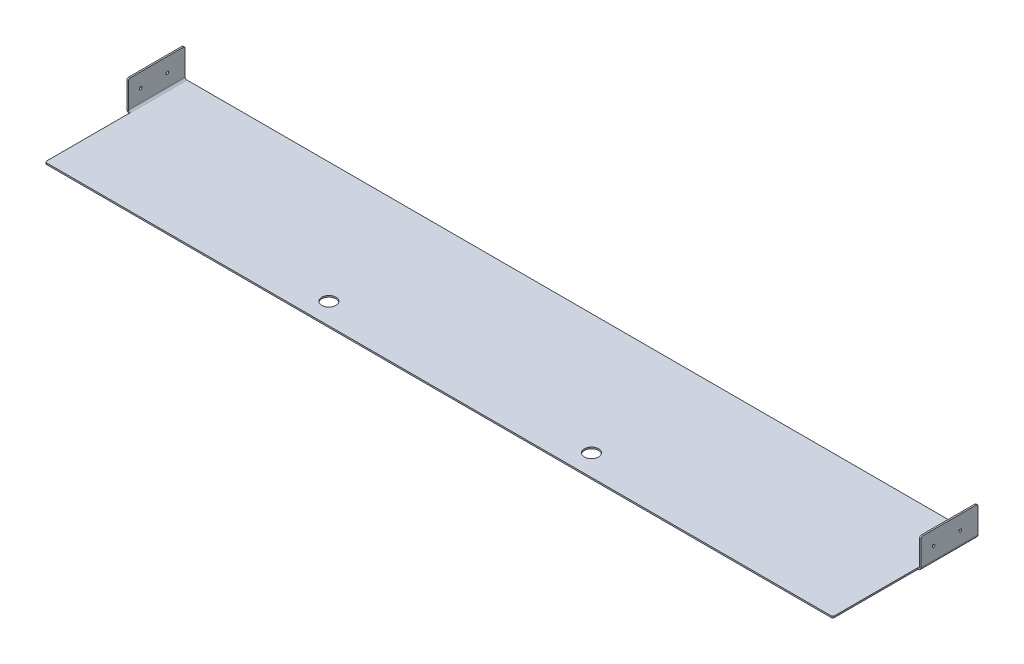
ISO-10303-21;
HEADER;
FILE_DESCRIPTION(('STEP AP214'),'2;1');
FILE_NAME('part.step','',(''),(''),'','','');
FILE_SCHEMA(('AUTOMOTIVE_DESIGN { 1 0 10303 214 1 1 1 1 }'));
ENDSEC;
DATA;
#1=APPLICATION_CONTEXT('core data for automotive mechanical design processes');
#2=APPLICATION_PROTOCOL_DEFINITION('international standard','automotive_design',2000,#1);
#3=PRODUCT_CONTEXT('',#1,'mechanical');
#4=PRODUCT('Part','Part','',(#3));
#5=PRODUCT_RELATED_PRODUCT_CATEGORY('part','',(#4));
#6=PRODUCT_DEFINITION_FORMATION('','',#4);
#7=PRODUCT_DEFINITION_CONTEXT('part definition',#1,'design');
#8=PRODUCT_DEFINITION('design','',#6,#7);
#9=PRODUCT_DEFINITION_SHAPE('','',#8);
#10=(LENGTH_UNIT() NAMED_UNIT(*) SI_UNIT(.MILLI.,.METRE.));
#11=(NAMED_UNIT(*) PLANE_ANGLE_UNIT() SI_UNIT($,.RADIAN.));
#12=(NAMED_UNIT(*) SI_UNIT($,.STERADIAN.) SOLID_ANGLE_UNIT());
#13=UNCERTAINTY_MEASURE_WITH_UNIT(LENGTH_MEASURE(1.E-05),#10,'distance_accuracy_value','');
#14=(GEOMETRIC_REPRESENTATION_CONTEXT(3) GLOBAL_UNCERTAINTY_ASSIGNED_CONTEXT((#13)) GLOBAL_UNIT_ASSIGNED_CONTEXT((#10,
#11,#12)) REPRESENTATION_CONTEXT('',''));
#15=CARTESIAN_POINT('',(0.,0.,0.));
#16=DIRECTION('',(0.,0.,1.));
#17=DIRECTION('',(1.,0.,0.));
#18=AXIS2_PLACEMENT_3D('',#15,#16,#17);
#19=CARTESIAN_POINT('',(-5.83183999999999,0.,0.));
#20=DIRECTION('',(1.,0.,0.));
#21=DIRECTION('',(0.,1.,0.));
#22=AXIS2_PLACEMENT_3D('',#19,#20,#21);
#23=PLANE('',#22);
#24=CARTESIAN_POINT('',(-5.83184000000008,25.3999999999635,-174.625));
#25=DIRECTION('',(-1.,0.,0.));
#26=DIRECTION('',(0.,0.,1.));
#27=AXIS2_PLACEMENT_3D('',#24,#25,#26);
#28=CIRCLE('',#27,2.45744999999999);
#29=CARTESIAN_POINT('',(-5.83184000000008,25.3999999999635,-172.16755));
#30=VERTEX_POINT('',#29);
#31=EDGE_CURVE('E777',#30,#30,#28,.T.);
#32=ORIENTED_EDGE('',*,*,#31,.F.);
#33=EDGE_LOOP('',(#32));
#34=FACE_BOUND('',#33,.T.);
#35=DIRECTION('',(0.,0.,-1.));
#36=VECTOR('',#35,1.);
#37=CARTESIAN_POINT('',(-5.83184000000016,50.8,0.));
#38=LINE('',#37,#36);
#39=CARTESIAN_POINT('',(-5.83184000000016,50.8,-155.575));
#40=VERTEX_POINT('',#39);
#41=CARTESIAN_POINT('',(-5.83184000000016,50.8,-250.825));
#42=VERTEX_POINT('',#41);
#43=EDGE_CURVE('E287',#40,#42,#38,.T.);
#44=ORIENTED_EDGE('',*,*,#43,.T.);
#45=CARTESIAN_POINT('',(-5.83184000000016,47.625,-250.825));
#46=DIRECTION('',(1.,0.,0.));
#47=DIRECTION('',(0.,1.,0.));
#48=AXIS2_PLACEMENT_3D('',#45,#46,#47);
#49=CIRCLE('',#48,3.175);
#50=CARTESIAN_POINT('',(-5.83184000000016,47.625,-254.));
#51=VERTEX_POINT('',#50);
#52=EDGE_CURVE('E393',#42,#51,#49,.F.);
#53=ORIENTED_EDGE('',*,*,#52,.T.);
#54=DIRECTION('',(0.,-1.,0.));
#55=VECTOR('',#54,1.);
#56=CARTESIAN_POINT('',(-5.83183999999999,0.,-254.));
#57=LINE('',#56,#55);
#58=CARTESIAN_POINT('',(-5.83184000000001,3.17499999999996,-254.));
#59=VERTEX_POINT('',#58);
#60=EDGE_CURVE('E284',#51,#59,#57,.T.);
#61=ORIENTED_EDGE('',*,*,#60,.T.);
#62=DIRECTION('',(0.,0.,1.));
#63=VECTOR('',#62,1.);
#64=CARTESIAN_POINT('',(-5.83184,3.17499999999996,-254.));
#65=LINE('',#64,#63);
#66=CARTESIAN_POINT('',(-5.83184,3.17499999999997,-152.4));
#67=VERTEX_POINT('',#66);
#68=EDGE_CURVE('E301',#67,#59,#65,.F.);
#69=ORIENTED_EDGE('',*,*,#68,.F.);
#70=DIRECTION('',(0.,1.,0.));
#71=VECTOR('',#70,1.);
#72=CARTESIAN_POINT('',(-5.83183999999999,0.,-152.4));
#73=LINE('',#72,#71);
#74=CARTESIAN_POINT('',(-5.83184000000016,47.625,-152.4));
#75=VERTEX_POINT('',#74);
#76=EDGE_CURVE('E290',#67,#75,#73,.T.);
#77=ORIENTED_EDGE('',*,*,#76,.T.);
#78=CARTESIAN_POINT('',(-5.83184000000016,47.625,-155.575));
#79=DIRECTION('',(1.,0.,0.));
#80=DIRECTION('',(0.,1.,0.));
#81=AXIS2_PLACEMENT_3D('',#78,#79,#80);
#82=CIRCLE('',#81,3.175);
#83=EDGE_CURVE('E391',#75,#40,#82,.F.);
#84=ORIENTED_EDGE('',*,*,#83,.T.);
#85=EDGE_LOOP('',(#44,#53,#61,#69,#77,#84));
#86=FACE_BOUND('',#85,.T.);
#87=CARTESIAN_POINT('',(-5.83184000000008,25.3999999999635,-222.25));
#88=DIRECTION('',(-1.,0.,0.));
#89=DIRECTION('',(0.,0.,1.));
#90=AXIS2_PLACEMENT_3D('',#87,#88,#89);
#91=CIRCLE('',#90,2.45744999999999);
#92=CARTESIAN_POINT('',(-5.83184000000008,25.3999999999635,-219.79255));
#93=VERTEX_POINT('',#92);
#94=EDGE_CURVE('E742',#93,#93,#91,.T.);
#95=ORIENTED_EDGE('',*,*,#94,.F.);
#96=EDGE_LOOP('',(#95));
#97=FACE_BOUND('',#96,.T.);
#98=ADVANCED_FACE('F79',(#34,#86,#97),#23,.F.);
#99=CARTESIAN_POINT('',(0.,0.,0.));
#100=DIRECTION('',(0.,-1.,0.));
#101=DIRECTION('',(0.,0.,-1.));
#102=AXIS2_PLACEMENT_3D('',#99,#100,#101);
#103=PLANE('',#102);
#104=CARTESIAN_POINT('',(939.8,0.,-38.1000000000001));
#105=DIRECTION('',(0.,1.,0.));
#106=DIRECTION('',(0.,0.,1.));
#107=AXIS2_PLACEMENT_3D('',#104,#105,#106);
#108=CIRCLE('',#107,12.6999999999999);
#109=CARTESIAN_POINT('',(939.8,0.,-25.4000000000001));
#110=VERTEX_POINT('',#109);
#111=EDGE_CURVE('E759',#110,#110,#108,.T.);
#112=ORIENTED_EDGE('',*,*,#111,.F.);
#113=EDGE_LOOP('',(#112));
#114=FACE_BOUND('',#113,.T.);
#115=DIRECTION('',(0.,0.,1.));
#116=VECTOR('',#115,1.);
#117=CARTESIAN_POINT('',(0.,0.,0.));
#118=LINE('',#117,#116);
#119=CARTESIAN_POINT('',(0.,0.,-152.4));
#120=VERTEX_POINT('',#119);
#121=CARTESIAN_POINT('',(0.,0.,-3.175));
#122=VERTEX_POINT('',#121);
#123=EDGE_CURVE('E324',#120,#122,#118,.T.);
#124=ORIENTED_EDGE('',*,*,#123,.T.);
#125=CARTESIAN_POINT('',(3.175,0.,-3.175));
#126=DIRECTION('',(0.,-1.,0.));
#127=DIRECTION('',(0.,0.,-1.));
#128=AXIS2_PLACEMENT_3D('',#125,#126,#127);
#129=CIRCLE('',#128,3.175);
#130=CARTESIAN_POINT('',(3.175,0.,0.));
#131=VERTEX_POINT('',#130);
#132=EDGE_CURVE('E402',#122,#131,#129,.F.);
#133=ORIENTED_EDGE('',*,*,#132,.T.);
#134=DIRECTION('',(1.,0.,0.));
#135=VECTOR('',#134,1.);
#136=CARTESIAN_POINT('',(0.,0.,0.));
#137=LINE('',#136,#135);
#138=CARTESIAN_POINT('',(1406.525,0.,0.));
#139=VERTEX_POINT('',#138);
#140=EDGE_CURVE('E340',#131,#139,#137,.T.);
#141=ORIENTED_EDGE('',*,*,#140,.T.);
#142=CARTESIAN_POINT('',(1406.525,0.,-3.175));
#143=DIRECTION('',(0.,-1.,0.));
#144=DIRECTION('',(0.,0.,-1.));
#145=AXIS2_PLACEMENT_3D('',#142,#143,#144);
#146=CIRCLE('',#145,3.175);
#147=CARTESIAN_POINT('',(1409.7,0.,-3.175));
#148=VERTEX_POINT('',#147);
#149=EDGE_CURVE('E400',#139,#148,#146,.F.);
#150=ORIENTED_EDGE('',*,*,#149,.T.);
#151=DIRECTION('',(0.,0.,-1.));
#152=VECTOR('',#151,1.);
#153=CARTESIAN_POINT('',(1409.7,0.,0.));
#154=LINE('',#153,#152);
#155=CARTESIAN_POINT('',(1409.7,0.,-152.4));
#156=VERTEX_POINT('',#155);
#157=EDGE_CURVE('E343',#148,#156,#154,.T.);
#158=ORIENTED_EDGE('',*,*,#157,.T.);
#159=DIRECTION('',(0.,0.,-1.));
#160=VECTOR('',#159,1.);
#161=CARTESIAN_POINT('',(1409.7,0.,-254.));
#162=LINE('',#161,#160);
#163=CARTESIAN_POINT('',(1409.7,0.,-254.));
#164=VERTEX_POINT('',#163);
#165=EDGE_CURVE('E277',#164,#156,#162,.F.);
#166=ORIENTED_EDGE('',*,*,#165,.F.);
#167=DIRECTION('',(-1.,0.,0.));
#168=VECTOR('',#167,1.);
#169=CARTESIAN_POINT('',(0.,0.,-254.));
#170=LINE('',#169,#168);
#171=CARTESIAN_POINT('',(0.,0.,-254.));
#172=VERTEX_POINT('',#171);
#173=EDGE_CURVE('E345',#164,#172,#170,.T.);
#174=ORIENTED_EDGE('',*,*,#173,.T.);
#175=EDGE_CURVE('E337',#172,#120,#118,.T.);
#176=ORIENTED_EDGE('',*,*,#175,.T.);
#177=EDGE_LOOP('',(#124,#133,#141,#150,#158,#166,#174,#176));
#178=FACE_BOUND('',#177,.T.);
#179=CARTESIAN_POINT('',(469.9,0.,-38.1));
#180=DIRECTION('',(0.,1.,0.));
#181=DIRECTION('',(0.,0.,1.));
#182=AXIS2_PLACEMENT_3D('',#179,#180,#181);
#183=CIRCLE('',#182,12.7);
#184=CARTESIAN_POINT('',(469.9,0.,-25.4));
#185=VERTEX_POINT('',#184);
#186=EDGE_CURVE('E753',#185,#185,#183,.T.);
#187=ORIENTED_EDGE('',*,*,#186,.F.);
#188=EDGE_LOOP('',(#187));
#189=FACE_BOUND('',#188,.T.);
#190=ADVANCED_FACE('F424',(#114,#178,#189),#103,.F.);
#191=CARTESIAN_POINT('',(0.,-2.65684,0.));
#192=DIRECTION('',(-1.,0.,0.));
#193=DIRECTION('',(0.,0.,1.));
#194=AXIS2_PLACEMENT_3D('',#191,#192,#193);
#195=PLANE('',#194);
#196=DIRECTION('',(0.,0.,1.));
#197=VECTOR('',#196,1.);
#198=CARTESIAN_POINT('',(0.,-2.65684,0.));
#199=LINE('',#198,#197);
#200=CARTESIAN_POINT('',(0.,-2.65684,-152.4));
#201=VERTEX_POINT('',#200);
#202=CARTESIAN_POINT('',(0.,-2.65684,-3.175));
#203=VERTEX_POINT('',#202);
#204=EDGE_CURVE('E329',#201,#203,#199,.T.);
#205=ORIENTED_EDGE('',*,*,#204,.T.);
#206=DIRECTION('',(0.,1.,0.));
#207=VECTOR('',#206,1.);
#208=CARTESIAN_POINT('',(0.,-2.65684,-3.175));
#209=LINE('',#208,#207);
#210=EDGE_CURVE('E397',#203,#122,#209,.T.);
#211=ORIENTED_EDGE('',*,*,#210,.T.);
#212=ORIENTED_EDGE('',*,*,#123,.F.);
#213=DIRECTION('',(0.,-1.,0.));
#214=VECTOR('',#213,1.);
#215=CARTESIAN_POINT('',(0.,0.,-152.4));
#216=LINE('',#215,#214);
#217=EDGE_CURVE('E314',#120,#201,#216,.T.);
#218=ORIENTED_EDGE('',*,*,#217,.T.);
#219=EDGE_LOOP('',(#205,#211,#212,#218));
#220=FACE_BOUND('',#219,.T.);
#221=ADVANCED_FACE('F418',(#220),#195,.T.);
#222=CARTESIAN_POINT('',(0.,-2.65684,-254.));
#223=DIRECTION('',(0.,0.,-1.));
#224=DIRECTION('',(-1.,0.,0.));
#225=AXIS2_PLACEMENT_3D('',#222,#223,#224);
#226=PLANE('',#225);
#227=ORIENTED_EDGE('',*,*,#173,.F.);
#228=DIRECTION('',(0.,1.,0.));
#229=VECTOR('',#228,1.);
#230=CARTESIAN_POINT('',(1409.7,-2.65684,-254.));
#231=LINE('',#230,#229);
#232=CARTESIAN_POINT('',(1409.7,-2.65684,-254.));
#233=VERTEX_POINT('',#232);
#234=EDGE_CURVE('E336',#233,#164,#231,.T.);
#235=ORIENTED_EDGE('',*,*,#234,.F.);
#236=DIRECTION('',(-1.,0.,0.));
#237=VECTOR('',#236,1.);
#238=CARTESIAN_POINT('',(0.,-2.65684,-254.));
#239=LINE('',#238,#237);
#240=CARTESIAN_POINT('',(0.,-2.65684000000002,-254.));
#241=VERTEX_POINT('',#240);
#242=EDGE_CURVE('E333',#233,#241,#239,.T.);
#243=ORIENTED_EDGE('',*,*,#242,.T.);
#244=DIRECTION('',(0.,1.,0.));
#245=VECTOR('',#244,1.);
#246=CARTESIAN_POINT('',(0.,-2.65684,-254.));
#247=LINE('',#246,#245);
#248=EDGE_CURVE('E348',#241,#172,#247,.T.);
#249=ORIENTED_EDGE('',*,*,#248,.T.);
#250=EDGE_LOOP('',(#227,#235,#243,#249));
#251=FACE_BOUND('',#250,.T.);
#252=ADVANCED_FACE('F517',(#251),#226,.T.);
#253=CARTESIAN_POINT('',(1409.7,-2.65684,0.));
#254=DIRECTION('',(1.,0.,0.));
#255=DIRECTION('',(0.,0.,-1.));
#256=AXIS2_PLACEMENT_3D('',#253,#254,#255);
#257=PLANE('',#256);
#258=ORIENTED_EDGE('',*,*,#157,.F.);
#259=DIRECTION('',(0.,1.,0.));
#260=VECTOR('',#259,1.);
#261=CARTESIAN_POINT('',(1409.7,-2.65684,-3.175));
#262=LINE('',#261,#260);
#263=CARTESIAN_POINT('',(1409.7,-2.65684,-3.175));
#264=VERTEX_POINT('',#263);
#265=EDGE_CURVE('E13',#148,#264,#262,.F.);
#266=ORIENTED_EDGE('',*,*,#265,.T.);
#267=DIRECTION('',(0.,0.,-1.));
#268=VECTOR('',#267,1.);
#269=CARTESIAN_POINT('',(1409.7,-2.65684,0.));
#270=LINE('',#269,#268);
#271=CARTESIAN_POINT('',(1409.7,-2.65683999999999,-152.4));
#272=VERTEX_POINT('',#271);
#273=EDGE_CURVE('E331',#264,#272,#270,.T.);
#274=ORIENTED_EDGE('',*,*,#273,.T.);
#275=DIRECTION('',(0.,-1.,0.));
#276=VECTOR('',#275,1.);
#277=CARTESIAN_POINT('',(1409.7,0.,-152.4));
#278=LINE('',#277,#276);
#279=EDGE_CURVE('E273',#156,#272,#278,.T.);
#280=ORIENTED_EDGE('',*,*,#279,.F.);
#281=EDGE_LOOP('',(#258,#266,#274,#280));
#282=FACE_BOUND('',#281,.T.);
#283=ADVANCED_FACE('F431',(#282),#257,.T.);
#284=CARTESIAN_POINT('',(0.,-2.65684,0.));
#285=DIRECTION('',(0.,0.,1.));
#286=DIRECTION('',(1.,0.,0.));
#287=AXIS2_PLACEMENT_3D('',#284,#285,#286);
#288=PLANE('',#287);
#289=ORIENTED_EDGE('',*,*,#140,.F.);
#290=DIRECTION('',(0.,1.,0.));
#291=VECTOR('',#290,1.);
#292=CARTESIAN_POINT('',(3.175,-2.65684,0.));
#293=LINE('',#292,#291);
#294=CARTESIAN_POINT('',(3.175,-2.65684,0.));
#295=VERTEX_POINT('',#294);
#296=EDGE_CURVE('E407',#131,#295,#293,.F.);
#297=ORIENTED_EDGE('',*,*,#296,.T.);
#298=DIRECTION('',(1.,0.,0.));
#299=VECTOR('',#298,1.);
#300=CARTESIAN_POINT('',(0.,-2.65684,0.));
#301=LINE('',#300,#299);
#302=CARTESIAN_POINT('',(1406.525,-2.65684,0.));
#303=VERTEX_POINT('',#302);
#304=EDGE_CURVE('E328',#295,#303,#301,.T.);
#305=ORIENTED_EDGE('',*,*,#304,.T.);
#306=DIRECTION('',(0.,1.,0.));
#307=VECTOR('',#306,1.);
#308=CARTESIAN_POINT('',(1406.525,-2.65684,0.));
#309=LINE('',#308,#307);
#310=EDGE_CURVE('E404',#303,#139,#309,.T.);
#311=ORIENTED_EDGE('',*,*,#310,.T.);
#312=EDGE_LOOP('',(#289,#297,#305,#311));
#313=FACE_BOUND('',#312,.T.);
#314=ADVANCED_FACE('F427',(#313),#288,.T.);
#315=CARTESIAN_POINT('',(0.,-2.65684,0.));
#316=DIRECTION('',(0.,-1.,0.));
#317=DIRECTION('',(0.,0.,-1.));
#318=AXIS2_PLACEMENT_3D('',#315,#316,#317);
#319=PLANE('',#318);
#320=CARTESIAN_POINT('',(469.9,-2.65684000000002,-38.1));
#321=DIRECTION('',(0.,1.,0.));
#322=DIRECTION('',(0.,0.,1.));
#323=AXIS2_PLACEMENT_3D('',#320,#321,#322);
#324=CIRCLE('',#323,12.7);
#325=CARTESIAN_POINT('',(469.9,-2.65684000000002,-25.4));
#326=VERTEX_POINT('',#325);
#327=EDGE_CURVE('E756',#326,#326,#324,.T.);
#328=ORIENTED_EDGE('',*,*,#327,.T.);
#329=EDGE_LOOP('',(#328));
#330=FACE_BOUND('',#329,.T.);
#331=CARTESIAN_POINT('',(939.8,-2.65684000000002,-38.1000000000001));
#332=DIRECTION('',(0.,1.,0.));
#333=DIRECTION('',(0.,0.,1.));
#334=AXIS2_PLACEMENT_3D('',#331,#332,#333);
#335=CIRCLE('',#334,12.6999999999999);
#336=CARTESIAN_POINT('',(939.8,-2.65684000000002,-25.4000000000001));
#337=VERTEX_POINT('',#336);
#338=EDGE_CURVE('E270',#337,#337,#335,.T.);
#339=ORIENTED_EDGE('',*,*,#338,.T.);
#340=EDGE_LOOP('',(#339));
#341=FACE_BOUND('',#340,.T.);
#342=ORIENTED_EDGE('',*,*,#304,.F.);
#343=CARTESIAN_POINT('',(3.175,-2.65684,-3.175));
#344=DIRECTION('',(0.,-1.,0.));
#345=DIRECTION('',(0.,0.,-1.));
#346=AXIS2_PLACEMENT_3D('',#343,#344,#345);
#347=CIRCLE('',#346,3.175);
#348=EDGE_CURVE('E87',#295,#203,#347,.T.);
#349=ORIENTED_EDGE('',*,*,#348,.T.);
#350=ORIENTED_EDGE('',*,*,#204,.F.);
#351=EDGE_CURVE('E325',#241,#201,#199,.T.);
#352=ORIENTED_EDGE('',*,*,#351,.F.);
#353=ORIENTED_EDGE('',*,*,#242,.F.);
#354=DIRECTION('',(0.,0.,-1.));
#355=VECTOR('',#354,1.);
#356=CARTESIAN_POINT('',(1409.7,-2.65683999999999,-254.));
#357=LINE('',#356,#355);
#358=EDGE_CURVE('E225',#233,#272,#357,.F.);
#359=ORIENTED_EDGE('',*,*,#358,.T.);
#360=ORIENTED_EDGE('',*,*,#273,.F.);
#361=CARTESIAN_POINT('',(1406.525,-2.65684,-3.175));
#362=DIRECTION('',(0.,-1.,0.));
#363=DIRECTION('',(0.,0.,-1.));
#364=AXIS2_PLACEMENT_3D('',#361,#362,#363);
#365=CIRCLE('',#364,3.175);
#366=EDGE_CURVE('E99',#264,#303,#365,.T.);
#367=ORIENTED_EDGE('',*,*,#366,.T.);
#368=EDGE_LOOP('',(#342,#349,#350,#352,#353,#359,#360,#367));
#369=FACE_BOUND('',#368,.T.);
#370=ADVANCED_FACE('F412',(#330,#341,#369),#319,.T.);
#371=CARTESIAN_POINT('',(0.,3.17499999999998,-254.));
#372=DIRECTION('',(0.,0.,-1.));
#373=DIRECTION('',(0.,1.,0.));
#374=AXIS2_PLACEMENT_3D('',#371,#372,#373);
#375=PLANE('',#374);
#376=DIRECTION('',(1.,0.,0.));
#377=VECTOR('',#376,1.);
#378=CARTESIAN_POINT('',(-5.83184,3.17499999999996,-254.));
#379=LINE('',#378,#377);
#380=CARTESIAN_POINT('',(-3.17500000000001,3.17499999999997,-254.));
#381=VERTEX_POINT('',#380);
#382=EDGE_CURVE('E283',#381,#59,#379,.F.);
#383=ORIENTED_EDGE('',*,*,#382,.F.);
#384=CARTESIAN_POINT('',(0.,3.17499999999998,-254.));
#385=DIRECTION('',(0.,0.,1.));
#386=DIRECTION('',(0.,-1.,0.));
#387=AXIS2_PLACEMENT_3D('',#384,#385,#386);
#388=CIRCLE('',#387,3.17500000000001);
#389=EDGE_CURVE('E317',#172,#381,#388,.F.);
#390=ORIENTED_EDGE('',*,*,#389,.F.);
#391=ORIENTED_EDGE('',*,*,#248,.F.);
#392=CARTESIAN_POINT('',(0.,3.17499999999998,-254.));
#393=DIRECTION('',(0.,0.,1.));
#394=DIRECTION('',(0.,-1.,0.));
#395=AXIS2_PLACEMENT_3D('',#392,#393,#394);
#396=CIRCLE('',#395,5.83184000000001);
#397=EDGE_CURVE('E311',#241,#59,#396,.F.);
#398=ORIENTED_EDGE('',*,*,#397,.T.);
#399=EDGE_LOOP('',(#383,#390,#391,#398));
#400=FACE_BOUND('',#399,.T.);
#401=ADVANCED_FACE('F507',(#400),#375,.T.);
#402=CARTESIAN_POINT('',(0.,3.17499999999999,-152.4));
#403=DIRECTION('',(0.,0.,-1.));
#404=DIRECTION('',(0.,1.,0.));
#405=AXIS2_PLACEMENT_3D('',#402,#403,#404);
#406=PLANE('',#405);
#407=CARTESIAN_POINT('',(0.,3.17499999999999,-152.4));
#408=DIRECTION('',(0.,0.,1.));
#409=DIRECTION('',(0.,-1.,0.));
#410=AXIS2_PLACEMENT_3D('',#407,#408,#409);
#411=CIRCLE('',#410,3.17500000000001);
#412=CARTESIAN_POINT('',(-3.17500000000001,3.17499999999998,-152.4));
#413=VERTEX_POINT('',#412);
#414=EDGE_CURVE('E286',#413,#120,#411,.T.);
#415=ORIENTED_EDGE('',*,*,#414,.F.);
#416=DIRECTION('',(1.,0.,0.));
#417=VECTOR('',#416,1.);
#418=CARTESIAN_POINT('',(-3.17500000000001,3.17499999999998,-152.4));
#419=LINE('',#418,#417);
#420=EDGE_CURVE('E304',#413,#67,#419,.F.);
#421=ORIENTED_EDGE('',*,*,#420,.T.);
#422=CARTESIAN_POINT('',(0.,3.17499999999999,-152.4));
#423=DIRECTION('',(0.,0.,1.));
#424=DIRECTION('',(0.,-1.,0.));
#425=AXIS2_PLACEMENT_3D('',#422,#423,#424);
#426=CIRCLE('',#425,5.83184000000001);
#427=EDGE_CURVE('E315',#67,#201,#426,.T.);
#428=ORIENTED_EDGE('',*,*,#427,.T.);
#429=ORIENTED_EDGE('',*,*,#217,.F.);
#430=EDGE_LOOP('',(#415,#421,#428,#429));
#431=FACE_BOUND('',#430,.T.);
#432=ADVANCED_FACE('F502',(#431),#406,.F.);
#433=CARTESIAN_POINT('',(0.,3.17499999999999,-152.4));
#434=DIRECTION('',(0.,0.,1.));
#435=DIRECTION('',(-1.,0.,0.));
#436=AXIS2_PLACEMENT_3D('',#433,#434,#435);
#437=CYLINDRICAL_SURFACE('',#436,5.83184000000001);
#438=ORIENTED_EDGE('',*,*,#351,.T.);
#439=ORIENTED_EDGE('',*,*,#427,.F.);
#440=ORIENTED_EDGE('',*,*,#68,.T.);
#441=ORIENTED_EDGE('',*,*,#397,.F.);
#442=EDGE_LOOP('',(#438,#439,#440,#441));
#443=FACE_BOUND('',#442,.T.);
#444=ADVANCED_FACE('F499',(#443),#437,.T.);
#445=CARTESIAN_POINT('',(0.,3.17499999999999,-152.4));
#446=DIRECTION('',(0.,0.,1.));
#447=DIRECTION('',(-1.,0.,0.));
#448=AXIS2_PLACEMENT_3D('',#445,#446,#447);
#449=CYLINDRICAL_SURFACE('',#448,3.17500000000001);
#450=ORIENTED_EDGE('',*,*,#175,.F.);
#451=ORIENTED_EDGE('',*,*,#389,.T.);
#452=DIRECTION('',(0.,0.,1.));
#453=VECTOR('',#452,1.);
#454=CARTESIAN_POINT('',(-3.17500000000001,3.17499999999997,-254.));
#455=LINE('',#454,#453);
#456=EDGE_CURVE('E307',#381,#413,#455,.T.);
#457=ORIENTED_EDGE('',*,*,#456,.T.);
#458=ORIENTED_EDGE('',*,*,#414,.T.);
#459=EDGE_LOOP('',(#450,#451,#457,#458));
#460=FACE_BOUND('',#459,.T.);
#461=ADVANCED_FACE('F497',(#460),#449,.F.);
#462=CARTESIAN_POINT('',(-5.83184000000017,50.8,-152.4));
#463=DIRECTION('',(0.,0.,-1.));
#464=DIRECTION('',(0.,1.,0.));
#465=AXIS2_PLACEMENT_3D('',#462,#463,#464);
#466=PLANE('',#465);
#467=DIRECTION('',(0.,-1.,0.));
#468=VECTOR('',#467,1.);
#469=CARTESIAN_POINT('',(-3.17500000000017,50.8,-152.4));
#470=LINE('',#469,#468);
#471=CARTESIAN_POINT('',(-3.17500000000015,47.625,-152.4));
#472=VERTEX_POINT('',#471);
#473=EDGE_CURVE('E298',#413,#472,#470,.F.);
#474=ORIENTED_EDGE('',*,*,#473,.T.);
#475=DIRECTION('',(1.,0.,0.));
#476=VECTOR('',#475,1.);
#477=CARTESIAN_POINT('',(-5.83184000000016,47.625,-152.4));
#478=LINE('',#477,#476);
#479=EDGE_CURVE('E395',#472,#75,#478,.F.);
#480=ORIENTED_EDGE('',*,*,#479,.T.);
#481=ORIENTED_EDGE('',*,*,#76,.F.);
#482=ORIENTED_EDGE('',*,*,#420,.F.);
#483=EDGE_LOOP('',(#474,#480,#481,#482));
#484=FACE_BOUND('',#483,.T.);
#485=ADVANCED_FACE('F490',(#484),#466,.F.);
#486=CARTESIAN_POINT('',(-5.83183999999999,0.,-254.));
#487=DIRECTION('',(0.,0.,1.));
#488=DIRECTION('',(1.,0.,0.));
#489=AXIS2_PLACEMENT_3D('',#486,#487,#488);
#490=PLANE('',#489);
#491=ORIENTED_EDGE('',*,*,#60,.F.);
#492=DIRECTION('',(1.,0.,0.));
#493=VECTOR('',#492,1.);
#494=CARTESIAN_POINT('',(-5.83184000000016,47.625,-254.));
#495=LINE('',#494,#493);
#496=CARTESIAN_POINT('',(-3.17500000000015,47.625,-254.));
#497=VERTEX_POINT('',#496);
#498=EDGE_CURVE('E379',#51,#497,#495,.T.);
#499=ORIENTED_EDGE('',*,*,#498,.T.);
#500=DIRECTION('',(0.,1.,0.));
#501=VECTOR('',#500,1.);
#502=CARTESIAN_POINT('',(-3.17499999999999,0.,-254.));
#503=LINE('',#502,#501);
#504=EDGE_CURVE('E293',#497,#381,#503,.F.);
#505=ORIENTED_EDGE('',*,*,#504,.T.);
#506=ORIENTED_EDGE('',*,*,#382,.T.);
#507=EDGE_LOOP('',(#491,#499,#505,#506));
#508=FACE_BOUND('',#507,.T.);
#509=ADVANCED_FACE('F486',(#508),#490,.F.);
#510=CARTESIAN_POINT('',(-3.17499999999999,0.,0.));
#511=DIRECTION('',(1.,0.,0.));
#512=DIRECTION('',(0.,1.,0.));
#513=AXIS2_PLACEMENT_3D('',#510,#511,#512);
#514=PLANE('',#513);
#515=CARTESIAN_POINT('',(-3.17500000000008,25.3999999999635,-174.625));
#516=DIRECTION('',(1.,0.,0.));
#517=DIRECTION('',(0.,1.,0.));
#518=AXIS2_PLACEMENT_3D('',#515,#516,#517);
#519=CIRCLE('',#518,2.45744999999991);
#520=CARTESIAN_POINT('',(-3.17500000000009,27.8574499999634,-174.625));
#521=VERTEX_POINT('',#520);
#522=EDGE_CURVE('E358',#521,#521,#519,.T.);
#523=ORIENTED_EDGE('',*,*,#522,.F.);
#524=EDGE_LOOP('',(#523));
#525=FACE_BOUND('',#524,.T.);
#526=CARTESIAN_POINT('',(-3.17500000000008,25.3999999999635,-222.25));
#527=DIRECTION('',(1.,0.,0.));
#528=DIRECTION('',(0.,1.,0.));
#529=AXIS2_PLACEMENT_3D('',#526,#527,#528);
#530=CIRCLE('',#529,2.45744999999991);
#531=CARTESIAN_POINT('',(-3.17500000000009,27.8574499999634,-222.25));
#532=VERTEX_POINT('',#531);
#533=EDGE_CURVE('E353',#532,#532,#530,.T.);
#534=ORIENTED_EDGE('',*,*,#533,.F.);
#535=EDGE_LOOP('',(#534));
#536=FACE_BOUND('',#535,.T.);
#537=ORIENTED_EDGE('',*,*,#504,.F.);
#538=CARTESIAN_POINT('',(-3.17500000000015,47.625,-250.825));
#539=DIRECTION('',(1.,0.,0.));
#540=DIRECTION('',(0.,1.,0.));
#541=AXIS2_PLACEMENT_3D('',#538,#539,#540);
#542=CIRCLE('',#541,3.175);
#543=CARTESIAN_POINT('',(-3.17500000000017,50.8,-250.825));
#544=VERTEX_POINT('',#543);
#545=EDGE_CURVE('E384',#497,#544,#542,.T.);
#546=ORIENTED_EDGE('',*,*,#545,.T.);
#547=DIRECTION('',(0.,0.,1.));
#548=VECTOR('',#547,1.);
#549=CARTESIAN_POINT('',(-3.17500000000017,50.8,-254.));
#550=LINE('',#549,#548);
#551=CARTESIAN_POINT('',(-3.17500000000017,50.8,-155.575));
#552=VERTEX_POINT('',#551);
#553=EDGE_CURVE('E295',#552,#544,#550,.F.);
#554=ORIENTED_EDGE('',*,*,#553,.F.);
#555=CARTESIAN_POINT('',(-3.17500000000015,47.625,-155.575));
#556=DIRECTION('',(1.,0.,0.));
#557=DIRECTION('',(0.,1.,0.));
#558=AXIS2_PLACEMENT_3D('',#555,#556,#557);
#559=CIRCLE('',#558,3.175);
#560=EDGE_CURVE('E382',#552,#472,#559,.T.);
#561=ORIENTED_EDGE('',*,*,#560,.T.);
#562=ORIENTED_EDGE('',*,*,#473,.F.);
#563=ORIENTED_EDGE('',*,*,#456,.F.);
#564=EDGE_LOOP('',(#537,#546,#554,#561,#562,#563));
#565=FACE_BOUND('',#564,.T.);
#566=ADVANCED_FACE('F482',(#525,#536,#565),#514,.T.);
#567=CARTESIAN_POINT('',(-5.83184000000017,50.8,-254.));
#568=DIRECTION('',(0.,-1.,0.));
#569=DIRECTION('',(1.,0.,0.));
#570=AXIS2_PLACEMENT_3D('',#567,#568,#569);
#571=PLANE('',#570);
#572=ORIENTED_EDGE('',*,*,#553,.T.);
#573=DIRECTION('',(1.,0.,0.));
#574=VECTOR('',#573,1.);
#575=CARTESIAN_POINT('',(-5.83184000000017,50.8,-250.825));
#576=LINE('',#575,#574);
#577=EDGE_CURVE('E389',#544,#42,#576,.F.);
#578=ORIENTED_EDGE('',*,*,#577,.T.);
#579=ORIENTED_EDGE('',*,*,#43,.F.);
#580=DIRECTION('',(1.,0.,0.));
#581=VECTOR('',#580,1.);
#582=CARTESIAN_POINT('',(-5.83184000000017,50.8,-155.575));
#583=LINE('',#582,#581);
#584=EDGE_CURVE('E386',#40,#552,#583,.T.);
#585=ORIENTED_EDGE('',*,*,#584,.T.);
#586=EDGE_LOOP('',(#572,#578,#579,#585));
#587=FACE_BOUND('',#586,.T.);
#588=ADVANCED_FACE('F485',(#587),#571,.F.);
#589=CARTESIAN_POINT('',(1409.7,3.17499999999994,-152.4));
#590=DIRECTION('',(0.,0.,1.));
#591=DIRECTION('',(1.,0.,0.));
#592=AXIS2_PLACEMENT_3D('',#589,#590,#591);
#593=PLANE('',#592);
#594=DIRECTION('',(-1.,0.,0.));
#595=VECTOR('',#594,1.);
#596=CARTESIAN_POINT('',(1415.53184,3.17499999999992,-152.4));
#597=LINE('',#596,#595);
#598=CARTESIAN_POINT('',(1412.875,3.17499999999993,-152.4));
#599=VERTEX_POINT('',#598);
#600=CARTESIAN_POINT('',(1415.53184,3.17499999999992,-152.4));
#601=VERTEX_POINT('',#600);
#602=EDGE_CURVE('E267',#599,#601,#597,.F.);
#603=ORIENTED_EDGE('',*,*,#602,.F.);
#604=CARTESIAN_POINT('',(1409.7,3.17499999999994,-152.4));
#605=DIRECTION('',(0.,0.,-1.));
#606=DIRECTION('',(-1.,0.,0.));
#607=AXIS2_PLACEMENT_3D('',#604,#605,#606);
#608=CIRCLE('',#607,3.17499999999993);
#609=EDGE_CURVE('E228',#156,#599,#608,.F.);
#610=ORIENTED_EDGE('',*,*,#609,.F.);
#611=ORIENTED_EDGE('',*,*,#279,.T.);
#612=CARTESIAN_POINT('',(1409.7,3.17499999999994,-152.4));
#613=DIRECTION('',(0.,0.,-1.));
#614=DIRECTION('',(-1.,0.,0.));
#615=AXIS2_PLACEMENT_3D('',#612,#613,#614);
#616=CIRCLE('',#615,5.83183999999993);
#617=EDGE_CURVE('E272',#272,#601,#616,.F.);
#618=ORIENTED_EDGE('',*,*,#617,.T.);
#619=EDGE_LOOP('',(#603,#610,#611,#618));
#620=FACE_BOUND('',#619,.T.);
#621=ADVANCED_FACE('F439',(#620),#593,.T.);
#622=CARTESIAN_POINT('',(1409.7,3.17499999999994,-254.));
#623=DIRECTION('',(0.,0.,1.));
#624=DIRECTION('',(1.,0.,0.));
#625=AXIS2_PLACEMENT_3D('',#622,#623,#624);
#626=PLANE('',#625);
#627=CARTESIAN_POINT('',(1409.7,3.17499999999994,-254.));
#628=DIRECTION('',(0.,0.,-1.));
#629=DIRECTION('',(-1.,0.,0.));
#630=AXIS2_PLACEMENT_3D('',#627,#628,#629);
#631=CIRCLE('',#630,3.17499999999993);
#632=CARTESIAN_POINT('',(1412.875,3.17499999999993,-254.));
#633=VERTEX_POINT('',#632);
#634=EDGE_CURVE('E235',#633,#164,#631,.T.);
#635=ORIENTED_EDGE('',*,*,#634,.F.);
#636=DIRECTION('',(-1.,0.,0.));
#637=VECTOR('',#636,1.);
#638=CARTESIAN_POINT('',(1412.875,3.17499999999993,-254.));
#639=LINE('',#638,#637);
#640=CARTESIAN_POINT('',(1415.53184,3.17499999999992,-254.));
#641=VERTEX_POINT('',#640);
#642=EDGE_CURVE('E232',#633,#641,#639,.F.);
#643=ORIENTED_EDGE('',*,*,#642,.T.);
#644=CARTESIAN_POINT('',(1409.7,3.17499999999994,-254.));
#645=DIRECTION('',(0.,0.,-1.));
#646=DIRECTION('',(-1.,0.,0.));
#647=AXIS2_PLACEMENT_3D('',#644,#645,#646);
#648=CIRCLE('',#647,5.83183999999993);
#649=EDGE_CURVE('E217',#641,#233,#648,.T.);
#650=ORIENTED_EDGE('',*,*,#649,.T.);
#651=ORIENTED_EDGE('',*,*,#234,.T.);
#652=EDGE_LOOP('',(#635,#643,#650,#651));
#653=FACE_BOUND('',#652,.T.);
#654=ADVANCED_FACE('F233',(#653),#626,.F.);
#655=CARTESIAN_POINT('',(1409.7,3.17499999999994,-254.));
#656=DIRECTION('',(0.,0.,-1.));
#657=DIRECTION('',(1.,0.,0.));
#658=AXIS2_PLACEMENT_3D('',#655,#656,#657);
#659=CYLINDRICAL_SURFACE('',#658,5.83183999999993);
#660=ORIENTED_EDGE('',*,*,#358,.F.);
#661=ORIENTED_EDGE('',*,*,#649,.F.);
#662=DIRECTION('',(0.,0.,-1.));
#663=VECTOR('',#662,1.);
#664=CARTESIAN_POINT('',(1415.53184,3.17499999999992,-152.4));
#665=LINE('',#664,#663);
#666=EDGE_CURVE('E222',#641,#601,#665,.F.);
#667=ORIENTED_EDGE('',*,*,#666,.T.);
#668=ORIENTED_EDGE('',*,*,#617,.F.);
#669=EDGE_LOOP('',(#660,#661,#667,#668));
#670=FACE_BOUND('',#669,.T.);
#671=ADVANCED_FACE('F219',(#670),#659,.T.);
#672=CARTESIAN_POINT('',(1409.7,3.17499999999994,-254.));
#673=DIRECTION('',(0.,0.,-1.));
#674=DIRECTION('',(1.,0.,0.));
#675=AXIS2_PLACEMENT_3D('',#672,#673,#674);
#676=CYLINDRICAL_SURFACE('',#675,3.17499999999993);
#677=ORIENTED_EDGE('',*,*,#165,.T.);
#678=ORIENTED_EDGE('',*,*,#609,.T.);
#679=DIRECTION('',(0.,0.,-1.));
#680=VECTOR('',#679,1.);
#681=CARTESIAN_POINT('',(1412.875,3.17499999999993,-152.4));
#682=LINE('',#681,#680);
#683=EDGE_CURVE('E240',#599,#633,#682,.T.);
#684=ORIENTED_EDGE('',*,*,#683,.T.);
#685=ORIENTED_EDGE('',*,*,#634,.T.);
#686=EDGE_LOOP('',(#677,#678,#684,#685));
#687=FACE_BOUND('',#686,.T.);
#688=ADVANCED_FACE('F435',(#687),#676,.F.);
#689=CARTESIAN_POINT('',(1415.53184,50.8,-254.));
#690=DIRECTION('',(0.,0.,1.));
#691=DIRECTION('',(1.,0.,0.));
#692=AXIS2_PLACEMENT_3D('',#689,#690,#691);
#693=PLANE('',#692);
#694=DIRECTION('',(0.,-1.,0.));
#695=VECTOR('',#694,1.);
#696=CARTESIAN_POINT('',(1412.875,50.8,-254.));
#697=LINE('',#696,#695);
#698=CARTESIAN_POINT('',(1412.875,47.625,-254.));
#699=VERTEX_POINT('',#698);
#700=EDGE_CURVE('E249',#633,#699,#697,.F.);
#701=ORIENTED_EDGE('',*,*,#700,.T.);
#702=DIRECTION('',(-1.,0.,0.));
#703=VECTOR('',#702,1.);
#704=CARTESIAN_POINT('',(1415.53184,47.625,-254.));
#705=LINE('',#704,#703);
#706=CARTESIAN_POINT('',(1415.53184,47.625,-254.));
#707=VERTEX_POINT('',#706);
#708=EDGE_CURVE('E253',#699,#707,#705,.F.);
#709=ORIENTED_EDGE('',*,*,#708,.T.);
#710=DIRECTION('',(0.,1.,0.));
#711=VECTOR('',#710,1.);
#712=CARTESIAN_POINT('',(1415.53184,-6.17101409394991E-12,-254.));
#713=LINE('',#712,#711);
#714=EDGE_CURVE('E245',#641,#707,#713,.T.);
#715=ORIENTED_EDGE('',*,*,#714,.F.);
#716=ORIENTED_EDGE('',*,*,#642,.F.);
#717=EDGE_LOOP('',(#701,#709,#715,#716));
#718=FACE_BOUND('',#717,.T.);
#719=ADVANCED_FACE('F251',(#718),#693,.F.);
#720=CARTESIAN_POINT('',(1415.53184,0.,-152.4));
#721=DIRECTION('',(0.,0.,-1.));
#722=DIRECTION('',(-1.,0.,0.));
#723=AXIS2_PLACEMENT_3D('',#720,#721,#722);
#724=PLANE('',#723);
#725=DIRECTION('',(0.,-1.,0.));
#726=VECTOR('',#725,1.);
#727=CARTESIAN_POINT('',(1415.53184,-6.17101409394991E-12,-152.4));
#728=LINE('',#727,#726);
#729=CARTESIAN_POINT('',(1415.53184,47.625,-152.4));
#730=VERTEX_POINT('',#729);
#731=EDGE_CURVE('E248',#730,#601,#728,.T.);
#732=ORIENTED_EDGE('',*,*,#731,.F.);
#733=DIRECTION('',(-1.,0.,0.));
#734=VECTOR('',#733,1.);
#735=CARTESIAN_POINT('',(1415.53184,47.625,-152.4));
#736=LINE('',#735,#734);
#737=CARTESIAN_POINT('',(1412.875,47.625,-152.4));
#738=VERTEX_POINT('',#737);
#739=EDGE_CURVE('E376',#730,#738,#736,.T.);
#740=ORIENTED_EDGE('',*,*,#739,.T.);
#741=DIRECTION('',(0.,1.,0.));
#742=VECTOR('',#741,1.);
#743=CARTESIAN_POINT('',(1412.875,0.,-152.4));
#744=LINE('',#743,#742);
#745=EDGE_CURVE('E255',#738,#599,#744,.F.);
#746=ORIENTED_EDGE('',*,*,#745,.T.);
#747=ORIENTED_EDGE('',*,*,#602,.T.);
#748=EDGE_LOOP('',(#732,#740,#746,#747));
#749=FACE_BOUND('',#748,.T.);
#750=ADVANCED_FACE('F441',(#749),#724,.F.);
#751=CARTESIAN_POINT('',(1415.53184,-6.17101409394991E-12,0.));
#752=DIRECTION('',(-1.,0.,0.));
#753=DIRECTION('',(0.,-1.,0.));
#754=AXIS2_PLACEMENT_3D('',#751,#752,#753);
#755=PLANE('',#754);
#756=CARTESIAN_POINT('',(1415.53184,25.3999999999635,-174.625));
#757=DIRECTION('',(-1.,0.,0.));
#758=DIRECTION('',(0.,0.,1.));
#759=AXIS2_PLACEMENT_3D('',#756,#757,#758);
#760=CIRCLE('',#759,2.45744999999983);
#761=CARTESIAN_POINT('',(1415.53184,25.3999999999635,-172.16755));
#762=VERTEX_POINT('',#761);
#763=EDGE_CURVE('E362',#762,#762,#760,.T.);
#764=ORIENTED_EDGE('',*,*,#763,.T.);
#765=EDGE_LOOP('',(#764));
#766=FACE_BOUND('',#765,.T.);
#767=CARTESIAN_POINT('',(1415.53184,25.3999999999635,-222.25));
#768=DIRECTION('',(-1.,0.,0.));
#769=DIRECTION('',(0.,0.,1.));
#770=AXIS2_PLACEMENT_3D('',#767,#768,#769);
#771=CIRCLE('',#770,2.45744999999983);
#772=CARTESIAN_POINT('',(1415.53184,25.3999999999635,-219.79255));
#773=VERTEX_POINT('',#772);
#774=EDGE_CURVE('E357',#773,#773,#771,.T.);
#775=ORIENTED_EDGE('',*,*,#774,.T.);
#776=EDGE_LOOP('',(#775));
#777=FACE_BOUND('',#776,.T.);
#778=ORIENTED_EDGE('',*,*,#714,.T.);
#779=CARTESIAN_POINT('',(1415.53184,47.625,-250.825));
#780=DIRECTION('',(-1.,0.,0.));
#781=DIRECTION('',(0.,-1.,0.));
#782=AXIS2_PLACEMENT_3D('',#779,#780,#781);
#783=CIRCLE('',#782,3.175);
#784=CARTESIAN_POINT('',(1415.53184,50.8,-250.825));
#785=VERTEX_POINT('',#784);
#786=EDGE_CURVE('E374',#707,#785,#783,.F.);
#787=ORIENTED_EDGE('',*,*,#786,.T.);
#788=DIRECTION('',(0.,0.,1.));
#789=VECTOR('',#788,1.);
#790=CARTESIAN_POINT('',(1415.53184,50.8,0.));
#791=LINE('',#790,#789);
#792=CARTESIAN_POINT('',(1415.53184,50.8,-155.575));
#793=VERTEX_POINT('',#792);
#794=EDGE_CURVE('E254',#785,#793,#791,.T.);
#795=ORIENTED_EDGE('',*,*,#794,.T.);
#796=CARTESIAN_POINT('',(1415.53184,47.625,-155.575));
#797=DIRECTION('',(-1.,0.,0.));
#798=DIRECTION('',(0.,-1.,0.));
#799=AXIS2_PLACEMENT_3D('',#796,#797,#798);
#800=CIRCLE('',#799,3.175);
#801=EDGE_CURVE('E372',#793,#730,#800,.F.);
#802=ORIENTED_EDGE('',*,*,#801,.T.);
#803=ORIENTED_EDGE('',*,*,#731,.T.);
#804=ORIENTED_EDGE('',*,*,#666,.F.);
#805=EDGE_LOOP('',(#778,#787,#795,#802,#803,#804));
#806=FACE_BOUND('',#805,.T.);
#807=ADVANCED_FACE('F244',(#766,#777,#806),#755,.F.);
#808=CARTESIAN_POINT('',(1412.875,-6.16173778666962E-12,0.));
#809=DIRECTION('',(-1.,0.,0.));
#810=DIRECTION('',(0.,-1.,0.));
#811=AXIS2_PLACEMENT_3D('',#808,#809,#810);
#812=PLANE('',#811);
#813=CARTESIAN_POINT('',(1412.875,25.3999999999635,-174.625));
#814=DIRECTION('',(-1.,0.,0.));
#815=DIRECTION('',(0.,-1.,0.));
#816=AXIS2_PLACEMENT_3D('',#813,#814,#815);
#817=CIRCLE('',#816,2.45744999999991);
#818=CARTESIAN_POINT('',(1412.875,22.9425499999636,-174.625));
#819=VERTEX_POINT('',#818);
#820=EDGE_CURVE('E361',#819,#819,#817,.T.);
#821=ORIENTED_EDGE('',*,*,#820,.F.);
#822=EDGE_LOOP('',(#821));
#823=FACE_BOUND('',#822,.T.);
#824=CARTESIAN_POINT('',(1412.875,25.3999999999635,-222.25));
#825=DIRECTION('',(-1.,0.,0.));
#826=DIRECTION('',(0.,-1.,0.));
#827=AXIS2_PLACEMENT_3D('',#824,#825,#826);
#828=CIRCLE('',#827,2.45744999999991);
#829=CARTESIAN_POINT('',(1412.875,22.9425499999636,-222.25));
#830=VERTEX_POINT('',#829);
#831=EDGE_CURVE('E356',#830,#830,#828,.T.);
#832=ORIENTED_EDGE('',*,*,#831,.F.);
#833=EDGE_LOOP('',(#832));
#834=FACE_BOUND('',#833,.T.);
#835=DIRECTION('',(0.,0.,-1.));
#836=VECTOR('',#835,1.);
#837=CARTESIAN_POINT('',(1412.875,50.8,-152.4));
#838=LINE('',#837,#836);
#839=CARTESIAN_POINT('',(1412.875,50.8,-250.825));
#840=VERTEX_POINT('',#839);
#841=CARTESIAN_POINT('',(1412.875,50.8,-155.575));
#842=VERTEX_POINT('',#841);
#843=EDGE_CURVE('E259',#840,#842,#838,.F.);
#844=ORIENTED_EDGE('',*,*,#843,.F.);
#845=CARTESIAN_POINT('',(1412.875,47.625,-250.825));
#846=DIRECTION('',(-1.,0.,0.));
#847=DIRECTION('',(0.,-1.,0.));
#848=AXIS2_PLACEMENT_3D('',#845,#846,#847);
#849=CIRCLE('',#848,3.175);
#850=EDGE_CURVE('E369',#840,#699,#849,.T.);
#851=ORIENTED_EDGE('',*,*,#850,.T.);
#852=ORIENTED_EDGE('',*,*,#700,.F.);
#853=ORIENTED_EDGE('',*,*,#683,.F.);
#854=ORIENTED_EDGE('',*,*,#745,.F.);
#855=CARTESIAN_POINT('',(1412.875,47.625,-155.575));
#856=DIRECTION('',(-1.,0.,0.));
#857=DIRECTION('',(0.,-1.,0.));
#858=AXIS2_PLACEMENT_3D('',#855,#856,#857);
#859=CIRCLE('',#858,3.175);
#860=EDGE_CURVE('E367',#738,#842,#859,.T.);
#861=ORIENTED_EDGE('',*,*,#860,.T.);
#862=EDGE_LOOP('',(#844,#851,#852,#853,#854,#861));
#863=FACE_BOUND('',#862,.T.);
#864=ADVANCED_FACE('F446',(#823,#834,#863),#812,.T.);
#865=CARTESIAN_POINT('',(1415.53184,50.8,-152.4));
#866=DIRECTION('',(0.,-1.,0.));
#867=DIRECTION('',(1.,0.,0.));
#868=AXIS2_PLACEMENT_3D('',#865,#866,#867);
#869=PLANE('',#868);
#870=ORIENTED_EDGE('',*,*,#794,.F.);
#871=DIRECTION('',(-1.,0.,0.));
#872=VECTOR('',#871,1.);
#873=CARTESIAN_POINT('',(1415.53184,50.8,-250.825));
#874=LINE('',#873,#872);
#875=EDGE_CURVE('E364',#785,#840,#874,.T.);
#876=ORIENTED_EDGE('',*,*,#875,.T.);
#877=ORIENTED_EDGE('',*,*,#843,.T.);
#878=DIRECTION('',(-1.,0.,0.));
#879=VECTOR('',#878,1.);
#880=CARTESIAN_POINT('',(1415.53184,50.8,-155.575));
#881=LINE('',#880,#879);
#882=EDGE_CURVE('E351',#842,#793,#881,.F.);
#883=ORIENTED_EDGE('',*,*,#882,.T.);
#884=EDGE_LOOP('',(#870,#876,#877,#883));
#885=FACE_BOUND('',#884,.T.);
#886=ADVANCED_FACE('F453',(#885),#869,.F.);
#887=CARTESIAN_POINT('',(939.8,0.,-38.1000000000001));
#888=DIRECTION('',(0.,1.,0.));
#889=DIRECTION('',(0.,0.,1.));
#890=AXIS2_PLACEMENT_3D('',#887,#888,#889);
#891=CYLINDRICAL_SURFACE('',#890,12.6999999999999);
#892=ORIENTED_EDGE('',*,*,#338,.F.);
#893=EDGE_LOOP('',(#892));
#894=FACE_BOUND('',#893,.T.);
#895=ORIENTED_EDGE('',*,*,#111,.T.);
#896=EDGE_LOOP('',(#895));
#897=FACE_BOUND('',#896,.T.);
#898=ADVANCED_FACE('F633',(#894,#897),#891,.F.);
#899=CARTESIAN_POINT('',(469.9,0.,-38.1));
#900=DIRECTION('',(0.,1.,0.));
#901=DIRECTION('',(0.,0.,1.));
#902=AXIS2_PLACEMENT_3D('',#899,#900,#901);
#903=CYLINDRICAL_SURFACE('',#902,12.7);
#904=ORIENTED_EDGE('',*,*,#327,.F.);
#905=EDGE_LOOP('',(#904));
#906=FACE_BOUND('',#905,.T.);
#907=ORIENTED_EDGE('',*,*,#186,.T.);
#908=EDGE_LOOP('',(#907));
#909=FACE_BOUND('',#908,.T.);
#910=ADVANCED_FACE('F640',(#906,#909),#903,.F.);
#911=CARTESIAN_POINT('',(-5.83184000000008,25.3999999999635,-222.25));
#912=DIRECTION('',(-1.,0.,0.));
#913=DIRECTION('',(0.,0.,1.));
#914=AXIS2_PLACEMENT_3D('',#911,#912,#913);
#915=CYLINDRICAL_SURFACE('',#914,2.45744999999991);
#916=ORIENTED_EDGE('',*,*,#533,.T.);
#917=EDGE_LOOP('',(#916));
#918=FACE_BOUND('',#917,.T.);
#919=ORIENTED_EDGE('',*,*,#94,.T.);
#920=EDGE_LOOP('',(#919));
#921=FACE_BOUND('',#920,.T.);
#922=ADVANCED_FACE('F648',(#918,#921),#915,.F.);
#923=ORIENTED_EDGE('',*,*,#831,.T.);
#924=EDGE_LOOP('',(#923));
#925=FACE_BOUND('',#924,.T.);
#926=ORIENTED_EDGE('',*,*,#774,.F.);
#927=EDGE_LOOP('',(#926));
#928=FACE_BOUND('',#927,.T.);
#929=ADVANCED_FACE('F656',(#925,#928),#915,.F.);
#930=CARTESIAN_POINT('',(-5.83184000000008,25.3999999999635,-174.625));
#931=DIRECTION('',(-1.,0.,0.));
#932=DIRECTION('',(0.,0.,1.));
#933=AXIS2_PLACEMENT_3D('',#930,#931,#932);
#934=CYLINDRICAL_SURFACE('',#933,2.45744999999991);
#935=ORIENTED_EDGE('',*,*,#522,.T.);
#936=EDGE_LOOP('',(#935));
#937=FACE_BOUND('',#936,.T.);
#938=ORIENTED_EDGE('',*,*,#31,.T.);
#939=EDGE_LOOP('',(#938));
#940=FACE_BOUND('',#939,.T.);
#941=ADVANCED_FACE('F664',(#937,#940),#934,.F.);
#942=ORIENTED_EDGE('',*,*,#820,.T.);
#943=EDGE_LOOP('',(#942));
#944=FACE_BOUND('',#943,.T.);
#945=ORIENTED_EDGE('',*,*,#763,.F.);
#946=EDGE_LOOP('',(#945));
#947=FACE_BOUND('',#946,.T.);
#948=ADVANCED_FACE('F467',(#944,#947),#934,.F.);
#949=CARTESIAN_POINT('',(1415.53184,47.625,-250.825));
#950=DIRECTION('',(-1.,0.,0.));
#951=DIRECTION('',(0.,-1.,0.));
#952=AXIS2_PLACEMENT_3D('',#949,#950,#951);
#953=CYLINDRICAL_SURFACE('',#952,3.175);
#954=ORIENTED_EDGE('',*,*,#786,.F.);
#955=ORIENTED_EDGE('',*,*,#708,.F.);
#956=ORIENTED_EDGE('',*,*,#850,.F.);
#957=ORIENTED_EDGE('',*,*,#875,.F.);
#958=EDGE_LOOP('',(#954,#955,#956,#957));
#959=FACE_BOUND('',#958,.T.);
#960=ADVANCED_FACE('F448',(#959),#953,.T.);
#961=CARTESIAN_POINT('',(1415.53184,47.625,-155.575));
#962=DIRECTION('',(-1.,0.,0.));
#963=DIRECTION('',(0.,-1.,0.));
#964=AXIS2_PLACEMENT_3D('',#961,#962,#963);
#965=CYLINDRICAL_SURFACE('',#964,3.175);
#966=ORIENTED_EDGE('',*,*,#801,.F.);
#967=ORIENTED_EDGE('',*,*,#882,.F.);
#968=ORIENTED_EDGE('',*,*,#860,.F.);
#969=ORIENTED_EDGE('',*,*,#739,.F.);
#970=EDGE_LOOP('',(#966,#967,#968,#969));
#971=FACE_BOUND('',#970,.T.);
#972=ADVANCED_FACE('F456',(#971),#965,.T.);
#973=CARTESIAN_POINT('',(-5.83184000000016,47.625,-250.825));
#974=DIRECTION('',(1.,0.,0.));
#975=DIRECTION('',(0.,1.,0.));
#976=AXIS2_PLACEMENT_3D('',#973,#974,#975);
#977=CYLINDRICAL_SURFACE('',#976,3.175);
#978=ORIENTED_EDGE('',*,*,#52,.F.);
#979=ORIENTED_EDGE('',*,*,#577,.F.);
#980=ORIENTED_EDGE('',*,*,#545,.F.);
#981=ORIENTED_EDGE('',*,*,#498,.F.);
#982=EDGE_LOOP('',(#978,#979,#980,#981));
#983=FACE_BOUND('',#982,.T.);
#984=ADVANCED_FACE('F458',(#983),#977,.T.);
#985=CARTESIAN_POINT('',(-5.83184000000016,47.625,-155.575));
#986=DIRECTION('',(1.,0.,0.));
#987=DIRECTION('',(0.,1.,0.));
#988=AXIS2_PLACEMENT_3D('',#985,#986,#987);
#989=CYLINDRICAL_SURFACE('',#988,3.175);
#990=ORIENTED_EDGE('',*,*,#83,.F.);
#991=ORIENTED_EDGE('',*,*,#479,.F.);
#992=ORIENTED_EDGE('',*,*,#560,.F.);
#993=ORIENTED_EDGE('',*,*,#584,.F.);
#994=EDGE_LOOP('',(#990,#991,#992,#993));
#995=FACE_BOUND('',#994,.T.);
#996=ADVANCED_FACE('F464',(#995),#989,.T.);
#997=CARTESIAN_POINT('',(3.175,-2.65684,-3.175));
#998=DIRECTION('',(0.,1.,0.));
#999=DIRECTION('',(0.,0.,1.));
#1000=AXIS2_PLACEMENT_3D('',#997,#998,#999);
#1001=CYLINDRICAL_SURFACE('',#1000,3.175);
#1002=ORIENTED_EDGE('',*,*,#348,.F.);
#1003=ORIENTED_EDGE('',*,*,#296,.F.);
#1004=ORIENTED_EDGE('',*,*,#132,.F.);
#1005=ORIENTED_EDGE('',*,*,#210,.F.);
#1006=EDGE_LOOP('',(#1002,#1003,#1004,#1005));
#1007=FACE_BOUND('',#1006,.T.);
#1008=ADVANCED_FACE('F421',(#1007),#1001,.T.);
#1009=CARTESIAN_POINT('',(1406.525,-2.65684,-3.175));
#1010=DIRECTION('',(0.,1.,0.));
#1011=DIRECTION('',(0.,0.,1.));
#1012=AXIS2_PLACEMENT_3D('',#1009,#1010,#1011);
#1013=CYLINDRICAL_SURFACE('',#1012,3.175);
#1014=ORIENTED_EDGE('',*,*,#366,.F.);
#1015=ORIENTED_EDGE('',*,*,#265,.F.);
#1016=ORIENTED_EDGE('',*,*,#149,.F.);
#1017=ORIENTED_EDGE('',*,*,#310,.F.);
#1018=EDGE_LOOP('',(#1014,#1015,#1016,#1017));
#1019=FACE_BOUND('',#1018,.T.);
#1020=ADVANCED_FACE('F81',(#1019),#1013,.T.);
#1021=CLOSED_SHELL('',(#98,#190,#221,#252,#283,#314,#370,#401,#432,#444,#461,#485,#509,#566,
#588,#621,#654,#671,#688,#719,#750,#807,#864,#886,#898,#910,#922,#929,#941,#948,#960,#972,#984,
#996,#1008,#1020));
#1022=MANIFOLD_SOLID_BREP('B2',#1021);
#1023=ADVANCED_BREP_SHAPE_REPRESENTATION('',(#18,#1022),#14);
#1024=SHAPE_DEFINITION_REPRESENTATION(#9,#1023);
ENDSEC;
END-ISO-10303-21;
